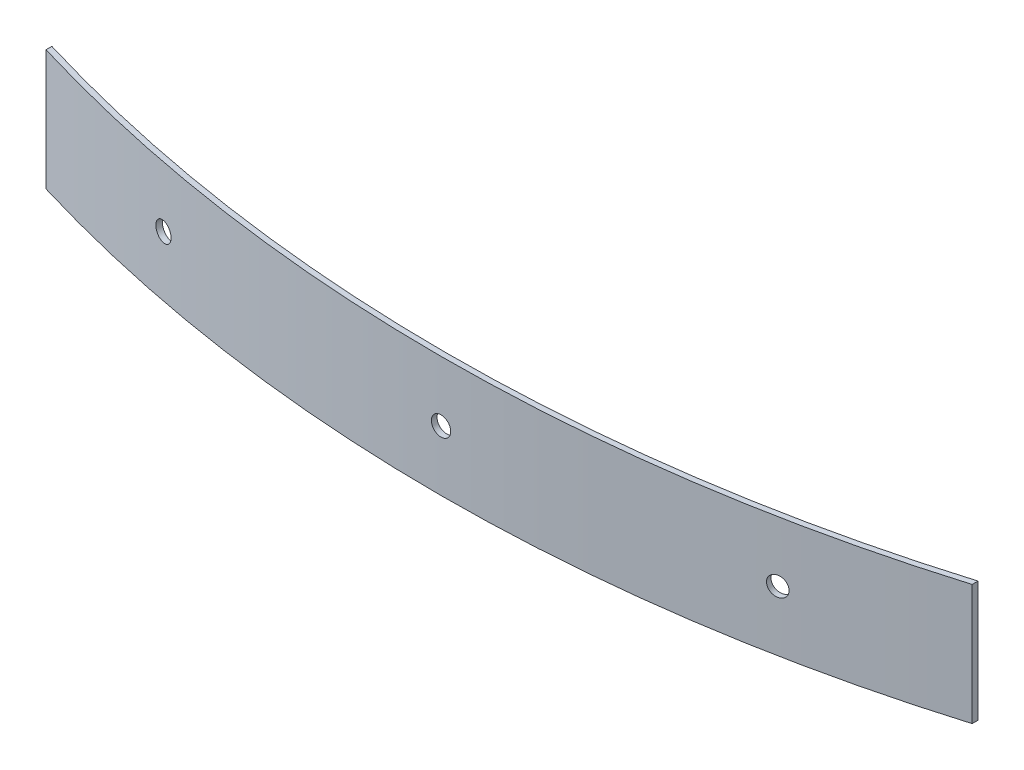
ISO-10303-21;
HEADER;
FILE_DESCRIPTION(('STEP AP214'),'2;1');
FILE_NAME('part.step','',(''),(''),'','','');
FILE_SCHEMA(('AUTOMOTIVE_DESIGN { 1 0 10303 214 1 1 1 1 }'));
ENDSEC;
DATA;
#1=APPLICATION_CONTEXT('core data for automotive mechanical design processes');
#2=APPLICATION_PROTOCOL_DEFINITION('international standard','automotive_design',2000,#1);
#3=PRODUCT_CONTEXT('',#1,'mechanical');
#4=PRODUCT('Part','Part','',(#3));
#5=PRODUCT_RELATED_PRODUCT_CATEGORY('part','',(#4));
#6=PRODUCT_DEFINITION_FORMATION('','',#4);
#7=PRODUCT_DEFINITION_CONTEXT('part definition',#1,'design');
#8=PRODUCT_DEFINITION('design','',#6,#7);
#9=PRODUCT_DEFINITION_SHAPE('','',#8);
#10=(LENGTH_UNIT() NAMED_UNIT(*) SI_UNIT(.MILLI.,.METRE.));
#11=(NAMED_UNIT(*) PLANE_ANGLE_UNIT() SI_UNIT($,.RADIAN.));
#12=(NAMED_UNIT(*) SI_UNIT($,.STERADIAN.) SOLID_ANGLE_UNIT());
#13=UNCERTAINTY_MEASURE_WITH_UNIT(LENGTH_MEASURE(1.E-05),#10,'distance_accuracy_value','');
#14=(GEOMETRIC_REPRESENTATION_CONTEXT(3) GLOBAL_UNCERTAINTY_ASSIGNED_CONTEXT((#13)) GLOBAL_UNIT_ASSIGNED_CONTEXT((#10,
#11,#12)) REPRESENTATION_CONTEXT('',''));
#15=CARTESIAN_POINT('',(0.,0.,0.));
#16=DIRECTION('',(0.,0.,1.));
#17=DIRECTION('',(1.,0.,0.));
#18=AXIS2_PLACEMENT_3D('',#15,#16,#17);
#19=CARTESIAN_POINT('',(40.4843717008192,387.477,-29.2982016179473));
#20=DIRECTION('',(0.190808995376545,0.,0.981627183447664));
#21=DIRECTION('',(0.981627183447664,0.,-0.190808995376545));
#22=AXIS2_PLACEMENT_3D('',#19,#20,#21);
#23=CYLINDRICAL_SURFACE('',#22,1.52400000000001);
#24=CARTESIAN_POINT('',(49.8636795486858,387.477,10.967109408025));
#25=CARTESIAN_POINT('',(49.863676090031,387.391468363897,10.9671101371769));
#26=CARTESIAN_POINT('',(49.8565909918501,387.305821015081,10.9685318877674));
#27=CARTESIAN_POINT('',(49.8284117889358,387.136831434247,10.9741828677333));
#28=CARTESIAN_POINT('',(49.8072877007544,387.05349453441,10.9784181059413));
#29=CARTESIAN_POINT('',(49.7516270676304,386.891678201409,10.9895654870844));
#30=CARTESIAN_POINT('',(49.7171017141455,386.813194778319,10.9964753963762));
#31=CARTESIAN_POINT('',(49.6356334347848,386.663294870702,11.0127562341792));
#32=CARTESIAN_POINT('',(49.5886963890027,386.591875061712,11.0221259973087));
#33=CARTESIAN_POINT('',(49.483714499149,386.458067156038,11.0430443220652));
#34=CARTESIAN_POINT('',(49.425667381307,386.395680912749,11.0545933296861));
#35=CARTESIAN_POINT('',(49.3001094634721,386.281724946985,11.0795205758699));
#36=CARTESIAN_POINT('',(49.2325978486417,386.230156156785,11.0928989719298));
#37=CARTESIAN_POINT('',(49.0900293943002,386.139306832435,11.1210832489984));
#38=CARTESIAN_POINT('',(49.0149727823577,386.100025927812,11.1358890869528));
#39=CARTESIAN_POINT('',(48.8594406720576,386.034865851215,11.1664905494899));
#40=CARTESIAN_POINT('',(48.7789652320242,386.008986535022,11.1822861634193));
#41=CARTESIAN_POINT('',(48.6148773814232,385.971363808313,11.2144063969075));
#42=CARTESIAN_POINT('',(48.5312649925577,385.959620300019,11.2307310128065));
#43=CARTESIAN_POINT('',(48.3632751458043,385.950602280154,11.2634400821675));
#44=CARTESIAN_POINT('',(48.2788976879837,385.953327767309,11.2798245356243));
#45=CARTESIAN_POINT('',(48.1117747959555,385.973170162921,11.3121892348023));
#46=CARTESIAN_POINT('',(48.0290293319527,385.990286808391,11.3281694879044));
#47=CARTESIAN_POINT('',(47.8675184506354,386.038425531047,11.3592810837368));
#48=CARTESIAN_POINT('',(47.7887530760175,386.069447757373,11.3744124173603));
#49=CARTESIAN_POINT('',(47.6374386382165,386.144518576551,11.4034116710556));
#50=CARTESIAN_POINT('',(47.5648898504967,386.188567746257,11.4172795351435));
#51=CARTESIAN_POINT('',(47.4280815732209,386.288437517213,11.4433753323079));
#52=CARTESIAN_POINT('',(47.3638213713957,386.344257105899,11.4556034063013));
#53=CARTESIAN_POINT('',(47.2454215969543,386.466073262848,11.478093308561));
#54=CARTESIAN_POINT('',(47.1912802279839,386.532068020951,11.4883554858328));
#55=CARTESIAN_POINT('',(47.0946210330584,386.672408184816,11.5066508012766));
#56=CARTESIAN_POINT('',(47.0521087197986,386.746757527548,11.5146828823098));
#57=CARTESIAN_POINT('',(46.9799236400397,386.901714043098,11.5283077204086));
#58=CARTESIAN_POINT('',(46.9502616084478,386.98232638188,11.5338984380318));
#59=CARTESIAN_POINT('',(46.9047202760055,387.147362145013,11.5424775595317));
#60=CARTESIAN_POINT('',(46.8888116411892,387.231777052148,11.5454715019914));
#61=CARTESIAN_POINT('',(46.8772100264779,387.343438639964,11.5476546828771));
#62=CARTESIAN_POINT('',(46.8751376769039,387.370104280899,11.548044629191));
#63=CARTESIAN_POINT('',(46.8723720662374,387.423509508253,11.5485649976085));
#64=CARTESIAN_POINT('',(46.8716788051456,387.450249094673,11.5486954197119));
#65=CARTESIAN_POINT('',(46.8716833734913,387.562531636103,11.5486946063558));
#66=CARTESIAN_POINT('',(46.878785159278,387.648178984919,11.5473587060549));
#67=CARTESIAN_POINT('',(46.9070293556091,387.817168565752,11.5420420882328));
#68=CARTESIAN_POINT('',(46.9282018172708,387.90050546559,11.5380557100068));
#69=CARTESIAN_POINT('',(46.9839853401138,388.062321798591,11.5275405416615));
#70=CARTESIAN_POINT('',(47.0185851880189,388.14080522168,11.5210138729379));
#71=CARTESIAN_POINT('',(47.1002201704887,388.290705129298,11.5055906482849));
#72=CARTESIAN_POINT('',(47.147249416566,388.362124938288,11.4966952145543));
#73=CARTESIAN_POINT('',(47.2524230722372,388.495932843962,11.4767634394047));
#74=CARTESIAN_POINT('',(47.3105697571067,388.558319087251,11.4657266597346));
#75=CARTESIAN_POINT('',(47.4363229421123,388.672275053015,11.4418039760585));
#76=CARTESIAN_POINT('',(47.5039302567522,388.723843843215,11.4289179128376));
#77=CARTESIAN_POINT('',(47.6466754418087,388.814693167564,11.4016428364789));
#78=CARTESIAN_POINT('',(47.721813085099,388.853974072188,11.3872538686703));
#79=CARTESIAN_POINT('',(47.8774834562706,388.919134148785,11.3573636966545));
#80=CARTESIAN_POINT('',(47.9580161260837,388.945013464978,11.3418625044183));
#81=CARTESIAN_POINT('',(48.1221881831383,388.982636191687,11.310175475579));
#82=CARTESIAN_POINT('',(48.2058275488868,388.994379699981,11.2939896437123));
#83=CARTESIAN_POINT('',(48.3738380555749,389.003397719846,11.2613868605009));
#84=CARTESIAN_POINT('',(48.4582091964499,389.000672232691,11.2449699091766));
#85=CARTESIAN_POINT('',(48.6252868733729,388.980829837078,11.2123725984479));
#86=CARTESIAN_POINT('',(48.7079934398115,388.963713191609,11.1961922347254));
#87=CARTESIAN_POINT('',(48.8693983302363,388.915574468953,11.1645353630211));
#88=CARTESIAN_POINT('',(48.9480966112234,388.884552242628,11.1490588625902));
#89=CARTESIAN_POINT('',(49.0992562265538,388.809481423449,11.1192631163317));
#90=CARTESIAN_POINT('',(49.1717172845199,388.765432253743,11.1049439217871));
#91=CARTESIAN_POINT('',(49.3083393680594,388.665562482787,11.0778902408885));
#92=CARTESIAN_POINT('',(49.3725011068256,388.609742894101,11.0651556183697));
#93=CARTESIAN_POINT('',(49.4907043317438,388.487926737152,11.041654556471));
#94=CARTESIAN_POINT('',(49.5447476141861,388.421931979049,11.0308877677573));
#95=CARTESIAN_POINT('',(49.6412220049104,388.281591815184,11.0116417171176));
#96=CARTESIAN_POINT('',(49.6836476058991,388.207242472452,11.0031635401216));
#97=CARTESIAN_POINT('',(49.7556804005782,388.052285956902,10.988755263204));
#98=CARTESIAN_POINT('',(49.7852768770475,387.97167361812,10.9828272937113));
#99=CARTESIAN_POINT('',(49.8307158606831,387.806637854987,10.9737216332465));
#100=CARTESIAN_POINT('',(49.8465876406186,387.722222947852,10.9705380888621));
#101=CARTESIAN_POINT('',(49.8581623044203,387.610561360036,10.9682162575659));
#102=CARTESIAN_POINT('',(49.8602298299466,387.583895719101,10.967801493678));
#103=CARTESIAN_POINT('',(49.8629889929448,387.530490491747,10.9672479548826));
#104=CARTESIAN_POINT('',(49.8636806304159,387.503750905327,10.9671091799752));
#105=CARTESIAN_POINT('',(49.8636795486858,387.477,10.967109408025));
#106=B_SPLINE_CURVE_WITH_KNOTS('',3,(#24,#25,#26,#27,#28,#29,#30,#31,#32,#33,#34,#35,#36,#37,
#38,#39,#40,#41,#42,#43,#44,#45,#46,#47,#48,#49,#50,#51,#52,#53,#54,#55,#56,#57,#58,#59,#60,#61,
#62,#63,#64,#65,#66,#67,#68,#69,#70,#71,#72,#73,#74,#75,#76,#77,#78,#79,#80,#81,#82,#83,#84,#85,
#86,#87,#88,#89,#90,#91,#92,#93,#94,#95,#96,#97,#98,#99,#100,#101,#102,#103,#104,#105),
.UNSPECIFIED.,.T.,.F.,(4,2,2,2,2,2,2,2,2,2,2,2,2,2,2,2,2,2,2,2,2,2,2,2,2,2,2,2,2,2,2,2,2,2,2,2,
2,2,2,2,4),(0.,0.256493168327267,0.513535903988114,0.77036444232639,1.0270715243331,
1.28383119990633,1.54061299457057,1.79738704663225,2.05415833541299,2.31092784811537,
2.56769733822554,2.82446213615993,3.08122968797572,3.33800861154674,3.59476545442572,
3.85147667295178,4.10830937407786,4.36535621708922,4.62185345491072,4.70207435061589,
4.78229524636296,5.03878841469023,5.29583115035106,5.55265968868932,5.80936677069605,
6.06612644626929,6.32290824093351,6.5796822929952,6.83645358177596,7.09322309447831,
7.34999258458847,7.60675738252288,7.86352493433864,8.12030385790964,8.37706070078866,
8.63377191931469,8.8906046204408,9.14765146345223,9.40414870127374,9.48436959697925,
9.56459049272649),.UNSPECIFIED.);
#107=CARTESIAN_POINT('',(49.8636795486858,387.477,10.967109408025));
#108=VERTEX_POINT('',#107);
#109=EDGE_CURVE('E94',#108,#108,#106,.T.);
#110=ORIENTED_EDGE('',*,*,#109,.T.);
#111=EDGE_LOOP('',(#110));
#112=FACE_BOUND('',#111,.T.);
#113=CARTESIAN_POINT('',(50.0333118005202,387.477,11.8397916904378));
#114=CARTESIAN_POINT('',(50.0333083418317,387.391468357998,11.8397924193975));
#115=CARTESIAN_POINT('',(50.0262232135201,387.305821003216,11.8412140201642));
#116=CARTESIAN_POINT('',(49.998043892993,387.136831410311,11.8468644166623));
#117=CARTESIAN_POINT('',(49.9769197171932,387.05349450437,11.8510992206214));
#118=CARTESIAN_POINT('',(49.921258860632,386.891678159086,11.8622454987522));
#119=CARTESIAN_POINT('',(49.8867333713161,386.813194729835,11.8691547394868));
#120=CARTESIAN_POINT('',(49.8052647868026,386.66329481109,11.8854340814312));
#121=CARTESIAN_POINT('',(49.7583275717262,386.591874997129,11.8948030173324));
#122=CARTESIAN_POINT('',(49.653345332499,386.458067089033,11.9157196209964));
#123=CARTESIAN_POINT('',(49.5952980354506,386.395680847581,11.927267734568));
#124=CARTESIAN_POINT('',(49.4697397662749,386.281724886822,11.9521932273473));
#125=CARTESIAN_POINT('',(49.4022279793126,386.230156099788,11.9655707640547));
#126=CARTESIAN_POINT('',(49.259659211236,386.139306785595,11.9937534533115));
#127=CARTESIAN_POINT('',(49.1846024580877,386.100025887312,12.0085585627273));
#128=CARTESIAN_POINT('',(49.0290701090603,386.034865822913,12.0391587817464));
#129=CARTESIAN_POINT('',(48.9485945715018,386.008986512585,12.0549538806948));
#130=CARTESIAN_POINT('',(48.784506573435,385.971363794815,12.0870733572215));
#131=CARTESIAN_POINT('',(48.7008941343601,385.959620290805,12.1033977311835));
#132=CARTESIAN_POINT('',(48.5329042462869,385.950602280327,12.1361066157797));
#133=CARTESIAN_POINT('',(48.4485267973555,385.953327772595,12.1524911264088));
#134=CARTESIAN_POINT('',(48.2814039729984,385.973170180107,12.1848562341798));
#135=CARTESIAN_POINT('',(48.1986585679236,385.990286833662,12.2008368386611));
#136=CARTESIAN_POINT('',(48.0371478550634,386.038425575947,12.2319493904473));
#137=CARTESIAN_POINT('',(47.9583825899741,386.069447813812,12.2470813286487));
#138=CARTESIAN_POINT('',(47.8070684129948,386.144518657696,12.2760819759015));
#139=CARTESIAN_POINT('',(47.7345197762846,386.188567839972,12.2899506290352));
#140=CARTESIAN_POINT('',(47.5977118224509,386.288437637766,12.3160481002875));
#141=CARTESIAN_POINT('',(47.5334517930494,386.34425724071,12.3282770593161));
#142=CARTESIAN_POINT('',(47.4150523728785,386.466073420107,12.3507687263608));
#143=CARTESIAN_POINT('',(47.3609111846376,386.532068185275,12.3610317836));
#144=CARTESIAN_POINT('',(47.2642523325177,386.672408361002,12.3793287565694));
#145=CARTESIAN_POINT('',(47.2217401813286,386.746757708532,12.3873616151113));
#146=CARTESIAN_POINT('',(47.1495553895778,386.901714230636,12.400987818055));
#147=CARTESIAN_POINT('',(47.1198934838635,386.982326571158,12.4065791228607));
#148=CARTESIAN_POINT('',(47.0743523527109,387.147362334862,12.4151591602165));
#149=CARTESIAN_POINT('',(47.0584437934114,387.231777240835,12.4181534318999));
#150=CARTESIAN_POINT('',(47.0468422428775,387.343438795619,12.4203368518533));
#151=CARTESIAN_POINT('',(47.0447699065702,387.370104405594,12.4207268406241));
#152=CARTESIAN_POINT('',(47.0420043136281,387.423509570751,12.4212472657896));
#153=CARTESIAN_POINT('',(47.0413110569942,387.450249125933,12.4213777021841));
#154=CARTESIAN_POINT('',(47.0413156252849,387.562531642002,12.4213768885776));
#155=CARTESIAN_POINT('',(47.0484173828835,387.648178996785,12.4200408380755));
#156=CARTESIAN_POINT('',(47.0766614696924,387.81716858969,12.4147236352129));
#157=CARTESIAN_POINT('',(47.0978338499199,387.90050549563,12.410736821536));
#158=CARTESIAN_POINT('',(47.1536171667348,388.062321840914,12.4002205467944));
#159=CARTESIAN_POINT('',(47.1882168901342,388.140805270166,12.3936932073122));
#160=CARTESIAN_POINT('',(47.2698515951784,388.29070518891,12.378268481411));
#161=CARTESIAN_POINT('',(47.3168806883374,388.362125002871,12.3693722172688));
#162=CARTESIAN_POINT('',(47.4220540232096,388.495932910967,12.3494387154724));
#163=CARTESIAN_POINT('',(47.4802005393196,388.558319152419,12.3384010397224));
#164=CARTESIAN_POINT('',(47.6059533932459,388.672275113178,12.3144765987033));
#165=CARTESIAN_POINT('',(47.6735605455646,388.723843900212,12.3015896742229));
#166=CARTESIAN_POINT('',(47.8163054267065,388.814693214406,12.2743130081434));
#167=CARTESIAN_POINT('',(47.8914429280052,388.853974112688,12.2599233119491));
#168=CARTESIAN_POINT('',(48.0471130546909,388.919134177087,12.2300318975348));
#169=CARTESIAN_POINT('',(48.1276456220123,388.945013487415,12.2145301912828));
#170=CARTESIAN_POINT('',(48.2918175322321,388.982636205185,12.1828424053593));
#171=CARTESIAN_POINT('',(48.3754568539029,388.994379709195,12.1666563303637));
#172=CARTESIAN_POINT('',(48.5434673296878,389.003397719673,12.1340533603628));
#173=CARTESIAN_POINT('',(48.6278384837381,389.000672227405,12.1176364653777));
#174=CARTESIAN_POINT('',(48.7949162509792,388.980829819893,12.0850395588399));
#175=CARTESIAN_POINT('',(48.8776228944096,388.963713166338,12.0688595429852));
#176=CARTESIAN_POINT('',(49.0390279867503,388.915574424053,12.0372036207311));
#177=CARTESIAN_POINT('',(49.1177263926632,388.884552186188,12.021727721885));
#178=CARTESIAN_POINT('',(49.2688862881996,388.809481342303,11.9919333654161));
#179=CARTESIAN_POINT('',(49.3413475017338,388.765432160027,11.9776149590313));
#180=CARTESIAN_POINT('',(49.4779699125073,388.665562362234,11.9505629514836));
#181=CARTESIAN_POINT('',(49.5421318229451,388.60974275929,11.9378292141462));
#182=CARTESIAN_POINT('',(49.6603353804895,388.487926579893,11.9143299212397));
#183=CARTESIAN_POINT('',(49.7143788250039,388.421931814724,11.90356401612));
#184=CARTESIAN_POINT('',(49.8108535188043,388.281591638997,11.8843196307285));
#185=CARTESIAN_POINT('',(49.8532792607835,388.207242291467,11.8758422353388));
#186=CARTESIAN_POINT('',(49.925312299706,388.052285769364,11.8614353317731));
#187=CARTESIAN_POINT('',(49.9549088794259,387.971673428842,11.8555079538611));
#188=CARTESIAN_POINT('',(50.0003480195146,387.806637665138,11.8464032179675));
#189=CARTESIAN_POINT('',(50.0162198527615,387.722222759165,11.8432200071233));
#190=CARTESIAN_POINT('',(50.0277945466152,387.610561204381,11.8408984215279));
#191=CARTESIAN_POINT('',(50.0298620757455,387.583895594406,11.8404837019752));
#192=CARTESIAN_POINT('',(50.032621243568,387.53049042925,11.8399302224354));
#193=CARTESIAN_POINT('',(50.0333128822595,387.503750874068,11.8397914624484));
#194=CARTESIAN_POINT('',(50.0333118005202,387.477,11.8397916904378));
#195=B_SPLINE_CURVE_WITH_KNOTS('',3,(#113,#114,#115,#116,#117,#118,#119,#120,#121,#122,#123,
#124,#125,#126,#127,#128,#129,#130,#131,#132,#133,#134,#135,#136,#137,#138,#139,#140,#141,#142,
#143,#144,#145,#146,#147,#148,#149,#150,#151,#152,#153,#154,#155,#156,#157,#158,#159,#160,#161,
#162,#163,#164,#165,#166,#167,#168,#169,#170,#171,#172,#173,#174,#175,#176,#177,#178,#179,#180,
#181,#182,#183,#184,#185,#186,#187,#188,#189,#190,#191,#192,#193,#194),.UNSPECIFIED.,.T.,.F.,(4,
2,2,2,2,2,2,2,2,2,2,2,2,2,2,2,2,2,2,2,2,2,2,2,2,2,2,2,2,2,2,2,2,2,2,2,2,2,2,2,4),(0.,
0.256493186147648,0.513535939917273,0.770364497343413,1.0270715981845,1.2838312723373,
1.54061306552852,1.79738710256763,2.05415837647021,2.3109278962541,2.56769739360345,
2.82446222194763,3.08122980409442,3.33800874622548,3.59476560744922,3.85147681594877,
4.10830950711869,4.36535633957911,4.6218535668253,4.70207436883022,4.78229517087661,
5.03878835702421,5.2958311107939,5.55265966822007,5.80936676906112,6.06612644321396,
6.32290823640518,6.57968227344427,6.83645354734683,7.09322306713074,7.34999256448009,
7.60675739282429,7.86352497497107,8.12030391710208,8.37706077832584,8.63377198682536,
8.89060467799531,9.14765151045561,9.4041487377019,9.48436953970654,9.56459034175266),.UNSPECIFIED.);
#196=CARTESIAN_POINT('',(50.0333118005202,387.477,11.8397916904378));
#197=VERTEX_POINT('',#196);
#198=EDGE_CURVE('E22',#197,#197,#195,.T.);
#199=ORIENTED_EDGE('',*,*,#198,.F.);
#200=EDGE_LOOP('',(#199));
#201=FACE_BOUND('',#200,.T.);
#202=ADVANCED_FACE('F18',(#112,#201),#23,.F.);
#203=CARTESIAN_POINT('',(73.1710645902476,508.,-1.57694107850936));
#204=DIRECTION('',(1.,0.,0.));
#205=DIRECTION('',(0.,0.,-1.));
#206=AXIS2_PLACEMENT_3D('',#203,#204,#205);
#207=PLANE('',#206);
#208=DIRECTION('',(0.,0.,1.));
#209=VECTOR('',#208,1.);
#210=CARTESIAN_POINT('',(73.1710645902476,397.002,-237.572238635431));
#211=LINE('',#210,#209);
#212=CARTESIAN_POINT('',(73.1710645902476,397.002,6.05799033406691));
#213=VERTEX_POINT('',#212);
#214=CARTESIAN_POINT('',(73.1710645902476,397.002,5.12961420201645));
#215=VERTEX_POINT('',#214);
#216=EDGE_CURVE('E71',#213,#215,#211,.F.);
#217=ORIENTED_EDGE('',*,*,#216,.F.);
#218=DIRECTION('',(0.,1.,0.));
#219=VECTOR('',#218,1.);
#220=CARTESIAN_POINT('',(73.1710645902476,508.,6.0579903340669));
#221=LINE('',#220,#219);
#222=CARTESIAN_POINT('',(73.1710645902476,377.952,6.05799033406691));
#223=VERTEX_POINT('',#222);
#224=EDGE_CURVE('E69',#213,#223,#221,.F.);
#225=ORIENTED_EDGE('',*,*,#224,.T.);
#226=DIRECTION('',(0.,0.,1.));
#227=VECTOR('',#226,1.);
#228=CARTESIAN_POINT('',(73.1710645902476,377.952,-237.572238635431));
#229=LINE('',#228,#227);
#230=CARTESIAN_POINT('',(73.1710645902476,377.952,5.12961420201645));
#231=VERTEX_POINT('',#230);
#232=EDGE_CURVE('E121',#223,#231,#229,.F.);
#233=ORIENTED_EDGE('',*,*,#232,.T.);
#234=DIRECTION('',(0.,1.,0.));
#235=VECTOR('',#234,1.);
#236=CARTESIAN_POINT('',(73.1710645902476,379.222,5.12961420201644));
#237=LINE('',#236,#235);
#238=EDGE_CURVE('E90',#231,#215,#237,.T.);
#239=ORIENTED_EDGE('',*,*,#238,.T.);
#240=EDGE_LOOP('',(#217,#225,#233,#239));
#241=FACE_BOUND('',#240,.T.);
#242=ADVANCED_FACE('F132',(#241),#207,.T.);
#243=CARTESIAN_POINT('',(0.,379.222,-237.572238635431));
#244=DIRECTION('',(0.,1.,0.));
#245=DIRECTION('',(0.,0.,1.));
#246=AXIS2_PLACEMENT_3D('',#243,#244,#245);
#247=CYLINDRICAL_SURFACE('',#246,254.381);
#248=CARTESIAN_POINT('',(-1.52400000000004,387.477,16.8041961713337));
#249=CARTESIAN_POINT('',(-1.52399635354439,387.562610232708,16.8041962308288));
#250=CARTESIAN_POINT('',(-1.51676266137329,387.648277180474,16.8042398498584));
#251=CARTESIAN_POINT('',(-1.48800823542495,387.817245920656,16.8044096469713));
#252=CARTESIAN_POINT('',(-1.46647171451255,387.900544993401,16.8045359162799));
#253=CARTESIAN_POINT('',(-1.40972442342295,388.062315641181,16.8048567143857));
#254=CARTESIAN_POINT('',(-1.37451942945186,388.140789239226,16.8050512143457));
#255=CARTESIAN_POINT('',(-1.29144398495152,388.290689380939,16.8054865103019));
#256=CARTESIAN_POINT('',(-1.24357684679906,388.362117760915,16.8057272941857));
#257=CARTESIAN_POINT('',(-1.13653171561487,388.495927204711,16.8062280500414));
#258=CARTESIAN_POINT('',(-1.07735359541627,388.558308166798,16.8064880222288));
#259=CARTESIAN_POINT('',(-0.949346645211421,388.672266043418,16.8069979174442));
#260=CARTESIAN_POINT('',(-0.880515295172995,388.723840127957,16.8072478378259));
#261=CARTESIAN_POINT('',(-0.735146804189286,388.814717858364,16.8077094770297));
#262=CARTESIAN_POINT('',(-0.658606368355173,388.854016227869,16.8079211794083));
#263=CARTESIAN_POINT('',(-0.500069174402144,388.919163619508,16.8082821403632));
#264=CARTESIAN_POINT('',(-0.418078536162053,388.945027448499,16.8084314676504));
#265=CARTESIAN_POINT('',(-0.279694921879424,388.976171848308,16.808613549031));
#266=CARTESIAN_POINT('',(-0.224172949217212,388.985470074983,16.808668721772));
#267=CARTESIAN_POINT('',(-0.112442141035052,388.997885348373,16.8087426490781));
#268=CARTESIAN_POINT('',(-0.0562333055256263,389.001002395184,16.8087614036438));
#269=CARTESIAN_POINT('',(0.0856102327227683,389.000996353544,16.808761305082));
#270=CARTESIAN_POINT('',(0.171277180504207,388.993762661371,16.808717686882));
#271=CARTESIAN_POINT('',(0.340245920718327,388.965008235411,16.808547892642));
#272=CARTESIAN_POINT('',(0.423544993480046,388.943471714491,16.808421625378));
#273=CARTESIAN_POINT('',(0.585315641296282,388.886724423377,16.8081008317467));
#274=CARTESIAN_POINT('',(0.663789239358908,388.851519429389,16.8079063342164));
#275=CARTESIAN_POINT('',(0.813689381102889,388.76844398485,16.8074710424001));
#276=CARTESIAN_POINT('',(0.885117761091838,388.720576846675,16.8072302602264));
#277=CARTESIAN_POINT('',(1.01892720487308,388.613531715468,16.8067295063414));
#278=CARTESIAN_POINT('',(1.08130816693737,388.554353595274,16.8064695344143));
#279=CARTESIAN_POINT('',(1.19526604351424,388.426346645089,16.8059596381373));
#280=CARTESIAN_POINT('',(1.24684012803135,388.357515295065,16.8057097164331));
#281=CARTESIAN_POINT('',(1.33771785841703,388.212146804093,16.8052480736206));
#282=CARTESIAN_POINT('',(1.37701622791746,388.135606368254,16.8050363689552));
#283=CARTESIAN_POINT('',(1.44216361954611,387.977069174292,16.8046754033987));
#284=CARTESIAN_POINT('',(1.46802744853206,387.895078536046,16.8045260737967));
#285=CARTESIAN_POINT('',(1.49917184832616,387.756694921778,16.8043439894566));
#286=CARTESIAN_POINT('',(1.50847007499384,387.701172949136,16.8042888157703));
#287=CARTESIAN_POINT('',(1.52088534837535,387.589442140994,16.8042148871694));
#288=CARTESIAN_POINT('',(1.5240023951839,387.533233305505,16.8041961322541));
#289=CARTESIAN_POINT('',(1.52399635354437,387.391389767293,16.8041962308287));
#290=CARTESIAN_POINT('',(1.5167626613733,387.305722819527,16.8042398498584));
#291=CARTESIAN_POINT('',(1.488008235425,387.136754079345,16.8044096469713));
#292=CARTESIAN_POINT('',(1.46647171451263,387.0534550066,16.8045359162799));
#293=CARTESIAN_POINT('',(1.40972442342307,386.891684358819,16.8048567143857));
#294=CARTESIAN_POINT('',(1.37451942945201,386.813210760775,16.8050512143458));
#295=CARTESIAN_POINT('',(1.2914439849517,386.663310619062,16.8054865103019));
#296=CARTESIAN_POINT('',(1.24357684679925,386.591882239085,16.8057272941858));
#297=CARTESIAN_POINT('',(1.1365317156151,386.45807279529,16.8062280500414));
#298=CARTESIAN_POINT('',(1.07735359541652,386.395691833203,16.8064880222288));
#299=CARTESIAN_POINT('',(0.949346645211702,386.281733956582,16.8069979174441));
#300=CARTESIAN_POINT('',(0.880515295173293,386.230159872044,16.807247837826));
#301=CARTESIAN_POINT('',(0.735146804189617,386.139282141636,16.8077094770297));
#302=CARTESIAN_POINT('',(0.65860636835552,386.099983772131,16.8079211794083));
#303=CARTESIAN_POINT('',(0.500069174402521,386.034836380492,16.8082821403632));
#304=CARTESIAN_POINT('',(0.418078536162445,386.008972551501,16.8084314676504));
#305=CARTESIAN_POINT('',(0.279694921879753,385.977828151692,16.808613549031));
#306=CARTESIAN_POINT('',(0.224172949217464,385.968529925017,16.808668721772));
#307=CARTESIAN_POINT('',(0.11244214103515,385.956114651627,16.8087426490781));
#308=CARTESIAN_POINT('',(0.0562333055256482,385.952997604816,16.8087614036438));
#309=CARTESIAN_POINT('',(-0.0856102327228215,385.953003646455,16.8087613050819));
#310=CARTESIAN_POINT('',(-0.17127718050426,385.960237338629,16.808717686882));
#311=CARTESIAN_POINT('',(-0.340245920718379,385.988991764588,16.808547892642));
#312=CARTESIAN_POINT('',(-0.423544993480096,386.010528285509,16.808421625378));
#313=CARTESIAN_POINT('',(-0.585315641296333,386.067275576623,16.8081008317467));
#314=CARTESIAN_POINT('',(-0.66378923935896,386.102480570611,16.8079063342164));
#315=CARTESIAN_POINT('',(-0.813689381102941,386.18555601515,16.8074710424));
#316=CARTESIAN_POINT('',(-0.885117761091888,386.233423153325,16.8072302602264));
#317=CARTESIAN_POINT('',(-1.01892720487312,386.340468284532,16.8067295063414));
#318=CARTESIAN_POINT('',(-1.08130816693741,386.399646404726,16.8064695344143));
#319=CARTESIAN_POINT('',(-1.19526604351428,386.527653354911,16.8059596381373));
#320=CARTESIAN_POINT('',(-1.2468401280314,386.596484704935,16.8057097164331));
#321=CARTESIAN_POINT('',(-1.33771785841709,386.741853195907,16.8052480736206));
#322=CARTESIAN_POINT('',(-1.37701622791753,386.818393631745,16.8050363689552));
#323=CARTESIAN_POINT('',(-1.44216361954617,386.976930825708,16.8046754033987));
#324=CARTESIAN_POINT('',(-1.46802744853212,387.058921463954,16.8045260737967));
#325=CARTESIAN_POINT('',(-1.49917184832624,387.197305078222,16.8043439894566));
#326=CARTESIAN_POINT('',(-1.50847007499392,387.252827050864,16.8042888157703));
#327=CARTESIAN_POINT('',(-1.52088534837544,387.364557859006,16.8042148871694));
#328=CARTESIAN_POINT('',(-1.52400239518397,387.420766694495,16.8041961322542));
#329=CARTESIAN_POINT('',(-1.52400000000004,387.477,16.8041961713337));
#330=B_SPLINE_CURVE_WITH_KNOTS('',3,(#248,#249,#250,#251,#252,#253,#254,#255,#256,#257,#258,
#259,#260,#261,#262,#263,#264,#265,#266,#267,#268,#269,#270,#271,#272,#273,#274,#275,#276,#277,
#278,#279,#280,#281,#282,#283,#284,#285,#286,#287,#288,#289,#290,#291,#292,#293,#294,#295,#296,
#297,#298,#299,#300,#301,#302,#303,#304,#305,#306,#307,#308,#309,#310,#311,#312,#313,#314,#315,
#316,#317,#318,#319,#320,#321,#322,#323,#324,#325,#326,#327,#328,#329),.UNSPECIFIED.,.T.,.F.,(4,
2,2,2,2,2,2,2,2,2,2,2,2,2,2,2,2,2,2,2,2,2,2,2,2,2,2,2,2,2,2,2,2,2,2,2,2,2,2,2,4),(0.,
0.256626105801758,0.513535941455357,0.770337326679153,1.02707159979487,1.28380875948736,
1.54061306711075,1.79752760330301,2.05415837749811,2.22272390965653,2.3912894392323,
2.64791554508076,2.90482538078008,3.16162676605713,3.41836103922532,3.67509819885677,
3.93190250642069,4.18881704263599,4.44544781685262,4.61401334895021,4.78257887846503,
5.03920498426683,5.29611481992047,5.55291620514429,5.80965047826003,6.06638763795252,
6.3231919455759,6.58010648176815,6.83673725596322,7.00530278812188,7.17386831769787,
7.43049442354634,7.68740425924565,7.94420564452271,8.20093991769089,8.45767707732229,
8.71448138488627,8.97139592110163,9.2280266953182,9.39659222741607,9.56515775693116),.UNSPECIFIED.);
#331=CARTESIAN_POINT('',(-1.52400000000004,387.477,16.8041961713337));
#332=VERTEX_POINT('',#331);
#333=EDGE_CURVE('E72',#332,#332,#330,.T.);
#334=ORIENTED_EDGE('',*,*,#333,.T.);
#335=EDGE_LOOP('',(#334));
#336=FACE_BOUND('',#335,.T.);
#337=CARTESIAN_POINT('',(0.,397.002,-237.572238635431));
#338=DIRECTION('',(0.,1.,0.));
#339=DIRECTION('',(0.,0.,1.));
#340=AXIS2_PLACEMENT_3D('',#337,#338,#339);
#341=CIRCLE('',#340,254.381);
#342=CARTESIAN_POINT('',(-73.1710645902477,397.002,6.05799033406691));
#343=VERTEX_POINT('',#342);
#344=EDGE_CURVE('E60',#343,#213,#341,.T.);
#345=ORIENTED_EDGE('',*,*,#344,.F.);
#346=DIRECTION('',(0.,1.,0.));
#347=VECTOR('',#346,1.);
#348=CARTESIAN_POINT('',(-73.1710645902477,508.,6.0579903340669));
#349=LINE('',#348,#347);
#350=CARTESIAN_POINT('',(-73.1710645902477,377.952,6.05799033406691));
#351=VERTEX_POINT('',#350);
#352=EDGE_CURVE('E68',#351,#343,#349,.T.);
#353=ORIENTED_EDGE('',*,*,#352,.F.);
#354=CARTESIAN_POINT('',(0.,377.952,-237.572238635431));
#355=DIRECTION('',(0.,1.,0.));
#356=DIRECTION('',(0.,0.,1.));
#357=AXIS2_PLACEMENT_3D('',#354,#355,#356);
#358=CIRCLE('',#357,254.381);
#359=EDGE_CURVE('E84',#351,#223,#358,.T.);
#360=ORIENTED_EDGE('',*,*,#359,.T.);
#361=ORIENTED_EDGE('',*,*,#224,.F.);
#362=EDGE_LOOP('',(#345,#353,#360,#361));
#363=FACE_BOUND('',#362,.T.);
#364=CARTESIAN_POINT('',(-47.0413121453717,387.477,12.4213775083455));
#365=CARTESIAN_POINT('',(-47.0413156252849,387.391468357997,12.4213768885777));
#366=CARTESIAN_POINT('',(-47.0484173828835,387.305821003215,12.4200408380755));
#367=CARTESIAN_POINT('',(-47.0766614696924,387.13683141031,12.4147236352129));
#368=CARTESIAN_POINT('',(-47.0978338499199,387.05349450437,12.410736821536));
#369=CARTESIAN_POINT('',(-47.1536171667348,386.891678159085,12.4002205467944));
#370=CARTESIAN_POINT('',(-47.1882168901342,386.813194729834,12.3936932073122));
#371=CARTESIAN_POINT('',(-47.2698515951784,386.66329481109,12.378268481411));
#372=CARTESIAN_POINT('',(-47.3168806883374,386.591874997129,12.3693722172688));
#373=CARTESIAN_POINT('',(-47.4220540232096,386.458067089033,12.3494387154724));
#374=CARTESIAN_POINT('',(-47.4802005393196,386.395680847581,12.3384010397224));
#375=CARTESIAN_POINT('',(-47.6059533932459,386.281724886822,12.3144765987033));
#376=CARTESIAN_POINT('',(-47.6735605455646,386.230156099788,12.3015896742229));
#377=CARTESIAN_POINT('',(-47.8163054267065,386.139306785594,12.2743130081434));
#378=CARTESIAN_POINT('',(-47.8914429280052,386.100025887312,12.2599233119491));
#379=CARTESIAN_POINT('',(-48.0471130546909,386.034865822913,12.2300318975348));
#380=CARTESIAN_POINT('',(-48.1276456220123,386.008986512585,12.2145301912828));
#381=CARTESIAN_POINT('',(-48.2918175322321,385.971363794815,12.1828424053593));
#382=CARTESIAN_POINT('',(-48.3754568539029,385.959620290805,12.1666563303637));
#383=CARTESIAN_POINT('',(-48.5434673296878,385.950602280327,12.1340533603628));
#384=CARTESIAN_POINT('',(-48.6278384837381,385.953327772595,12.1176364653777));
#385=CARTESIAN_POINT('',(-48.7949162509792,385.973170180107,12.0850395588399));
#386=CARTESIAN_POINT('',(-48.8776228944096,385.990286833662,12.0688595429852));
#387=CARTESIAN_POINT('',(-49.0390279867503,386.038425575947,12.0372036207311));
#388=CARTESIAN_POINT('',(-49.1177263926631,386.069447813812,12.021727721885));
#389=CARTESIAN_POINT('',(-49.2688862881997,386.144518657696,11.9919333654161));
#390=CARTESIAN_POINT('',(-49.3413475017338,386.188567839972,11.9776149590313));
#391=CARTESIAN_POINT('',(-49.4779699125074,386.288437637766,11.9505629514836));
#392=CARTESIAN_POINT('',(-49.5421318229451,386.34425724071,11.9378292141462));
#393=CARTESIAN_POINT('',(-49.6603353804895,386.466073420107,11.9143299212397));
#394=CARTESIAN_POINT('',(-49.7143788250039,386.532068185276,11.90356401612));
#395=CARTESIAN_POINT('',(-49.8108535188043,386.672408361003,11.8843196307285));
#396=CARTESIAN_POINT('',(-49.8532792607835,386.746757708533,11.8758422353388));
#397=CARTESIAN_POINT('',(-49.925312299706,386.901714230636,11.8614353317731));
#398=CARTESIAN_POINT('',(-49.9549088794259,386.982326571158,11.8555079538611));
#399=CARTESIAN_POINT('',(-50.0003480195146,387.147362334862,11.8464032179675));
#400=CARTESIAN_POINT('',(-50.0162198527615,387.231777240835,11.8432200071233));
#401=CARTESIAN_POINT('',(-50.0277945466152,387.343438795619,11.8408984215279));
#402=CARTESIAN_POINT('',(-50.0298620757456,387.370104405594,11.8404837019752));
#403=CARTESIAN_POINT('',(-50.0326212435681,387.423509570751,11.8399302224354));
#404=CARTESIAN_POINT('',(-50.0333128822595,387.450249125933,11.8397914624484));
#405=CARTESIAN_POINT('',(-50.0333083418317,387.562531642003,11.8397924193975));
#406=CARTESIAN_POINT('',(-50.02622321352,387.648178996785,11.8412140201643));
#407=CARTESIAN_POINT('',(-49.9980438929928,387.81716858969,11.8468644166623));
#408=CARTESIAN_POINT('',(-49.9769197171929,387.900505495631,11.8510992206214));
#409=CARTESIAN_POINT('',(-49.9212588606315,388.062321840915,11.8622454987523));
#410=CARTESIAN_POINT('',(-49.8867333713157,388.140805270166,11.8691547394869));
#411=CARTESIAN_POINT('',(-49.805264786802,388.290705188911,11.8854340814314));
#412=CARTESIAN_POINT('',(-49.7583275717256,388.362125002872,11.8948030173325));
#413=CARTESIAN_POINT('',(-49.6533453324983,388.495932910967,11.9157196209966));
#414=CARTESIAN_POINT('',(-49.5952980354499,388.55831915242,11.9272677345682));
#415=CARTESIAN_POINT('',(-49.4697397662741,388.672275113179,11.9521932273474));
#416=CARTESIAN_POINT('',(-49.4022279793116,388.723843900213,11.9655707640549));
#417=CARTESIAN_POINT('',(-49.259659211235,388.814693214406,11.9937534533117));
#418=CARTESIAN_POINT('',(-49.1846024580867,388.853974112688,12.0085585627275));
#419=CARTESIAN_POINT('',(-49.0290701090592,388.919134177087,12.0391587817466));
#420=CARTESIAN_POINT('',(-48.9485945715008,388.945013487415,12.054953880695));
#421=CARTESIAN_POINT('',(-48.7845065734339,388.982636205185,12.0870733572218));
#422=CARTESIAN_POINT('',(-48.700894134359,388.994379709195,12.1033977311837));
#423=CARTESIAN_POINT('',(-48.5329042462858,389.003397719673,12.13610661578));
#424=CARTESIAN_POINT('',(-48.4485267973543,389.000672227405,12.152491126409));
#425=CARTESIAN_POINT('',(-48.2814039729973,388.980829819893,12.18485623418));
#426=CARTESIAN_POINT('',(-48.1986585679225,388.963713166338,12.2008368386613));
#427=CARTESIAN_POINT('',(-48.0371478550624,388.915574424052,12.2319493904475));
#428=CARTESIAN_POINT('',(-47.958382589973,388.884552186188,12.2470813286489));
#429=CARTESIAN_POINT('',(-47.8070684129938,388.809481342303,12.2760819759017));
#430=CARTESIAN_POINT('',(-47.7345197762837,388.765432160027,12.2899506290353));
#431=CARTESIAN_POINT('',(-47.59771182245,388.665562362233,12.3160481002876));
#432=CARTESIAN_POINT('',(-47.5334517930486,388.60974275929,12.3282770593163));
#433=CARTESIAN_POINT('',(-47.4150523728777,388.487926579893,12.3507687263609));
#434=CARTESIAN_POINT('',(-47.3609111846369,388.421931814724,12.3610317836001));
#435=CARTESIAN_POINT('',(-47.2642523325171,388.281591638997,12.3793287565695));
#436=CARTESIAN_POINT('',(-47.2217401813281,388.207242291467,12.3873616151114));
#437=CARTESIAN_POINT('',(-47.1495553895774,388.052285769363,12.4009878180551));
#438=CARTESIAN_POINT('',(-47.1198934838632,387.971673428841,12.4065791228608));
#439=CARTESIAN_POINT('',(-47.0743523527106,387.806637665137,12.4151591602165));
#440=CARTESIAN_POINT('',(-47.0584437934112,387.722222759164,12.4181534318999));
#441=CARTESIAN_POINT('',(-47.0468422428774,387.61056120438,12.4203368518533));
#442=CARTESIAN_POINT('',(-47.0447699065701,387.583895594405,12.4207268406241));
#443=CARTESIAN_POINT('',(-47.0420043136281,387.530490429249,12.4212472657896));
#444=CARTESIAN_POINT('',(-47.0413110569942,387.503750874067,12.4213777021841));
#445=CARTESIAN_POINT('',(-47.0413121453717,387.477,12.4213775083455));
#446=B_SPLINE_CURVE_WITH_KNOTS('',3,(#364,#365,#366,#367,#368,#369,#370,#371,#372,#373,#374,
#375,#376,#377,#378,#379,#380,#381,#382,#383,#384,#385,#386,#387,#388,#389,#390,#391,#392,#393,
#394,#395,#396,#397,#398,#399,#400,#401,#402,#403,#404,#405,#406,#407,#408,#409,#410,#411,#412,
#413,#414,#415,#416,#417,#418,#419,#420,#421,#422,#423,#424,#425,#426,#427,#428,#429,#430,#431,
#432,#433,#434,#435,#436,#437,#438,#439,#440,#441,#442,#443,#444,#445),.UNSPECIFIED.,.T.,.F.,(4,
2,2,2,2,2,2,2,2,2,2,2,2,2,2,2,2,2,2,2,2,2,2,2,2,2,2,2,2,2,2,2,2,2,2,2,2,2,2,2,4),(0.,
0.256493186147596,0.51353593991729,0.77036449734345,1.0270715981845,1.28383127233734,
1.54061306552857,1.79738710256766,2.05415837647022,2.31092789625413,2.56769739360348,
2.82446222194766,3.08122980409445,3.33800874622551,3.59476560744923,3.85147681594876,
4.10830950711871,4.36535633957911,4.62185356682529,4.70207436883049,4.78229517087716,
5.03878835702482,5.29583111079444,5.55265966822066,5.80936676906168,6.0661264432145,
6.32290823640572,6.57968227344483,6.83645354734736,7.09322306713129,7.34999256448065,
7.60675739282483,7.86352497497161,8.12030391710265,8.37706077832642,8.6337719868259,
8.89060467799584,9.14765151045625,9.40414873770252,9.48436953970682,9.56459034175266),.UNSPECIFIED.);
#447=CARTESIAN_POINT('',(-47.0413121453717,387.477,12.4213775083455));
#448=VERTEX_POINT('',#447);
#449=EDGE_CURVE('E93',#448,#448,#446,.T.);
#450=ORIENTED_EDGE('',*,*,#449,.T.);
#451=EDGE_LOOP('',(#450));
#452=FACE_BOUND('',#451,.T.);
#453=ORIENTED_EDGE('',*,*,#198,.T.);
#454=EDGE_LOOP('',(#453));
#455=FACE_BOUND('',#454,.T.);
#456=ADVANCED_FACE('F65',(#336,#363,#452,#455),#247,.T.);
#457=CARTESIAN_POINT('',(0.,387.477,-25.4));
#458=DIRECTION('',(0.,0.,1.));
#459=DIRECTION('',(1.,0.,0.));
#460=AXIS2_PLACEMENT_3D('',#457,#458,#459);
#461=CYLINDRICAL_SURFACE('',#460,1.52400000000001);
#462=CARTESIAN_POINT('',(0.,385.953,15.9197613645694));
#463=CARTESIAN_POINT('',(-0.0856102267821858,385.953003646456,15.9197613048734));
#464=CARTESIAN_POINT('',(-0.171277168589614,385.960237337638,15.9197175337099));
#465=CARTESIAN_POINT('',(-0.340245896744171,385.98899175947,15.9195471440226));
#466=CARTESIAN_POINT('',(-0.423544963421584,386.010528277244,15.919420433955));
#467=CARTESIAN_POINT('',(-0.585315598978211,386.067275559501,15.9190985153389));
#468=CARTESIAN_POINT('',(-0.663789190884773,386.102480547724,15.9189033357288));
#469=CARTESIAN_POINT('',(-0.813689321502501,386.185555978143,15.9184665173893));
#470=CARTESIAN_POINT('',(-0.885117696515022,386.233423107973,15.9182248908149));
#471=CARTESIAN_POINT('',(-1.0189271378733,386.340468224625,15.9177223807995));
#472=CARTESIAN_POINT('',(-1.08130810177633,386.399646339501,15.9174614971405));
#473=CARTESIAN_POINT('',(-1.19526598335638,386.527653279366,15.9169498126198));
#474=CARTESIAN_POINT('',(-1.24684007103707,386.596484624389,15.9166990144131));
#475=CARTESIAN_POINT('',(-1.33771781157207,386.741853110342,15.916235752538));
#476=CARTESIAN_POINT('',(-1.37701618741135,386.818393546569,15.9160233053723));
#477=CARTESIAN_POINT('',(-1.44216359124197,386.976930743462,15.9156610738064));
#478=CARTESIAN_POINT('',(-1.4680274260943,387.058921384247,15.9155112204544));
#479=CARTESIAN_POINT('',(-1.4991718367933,387.197305013822,15.9153284974582));
#480=CARTESIAN_POINT('',(-1.50847006776657,387.252826998955,15.9152731302448));
#481=CARTESIAN_POINT('',(-1.52088534691471,387.364557832727,15.9151989423318));
#482=CARTESIAN_POINT('',(-1.52400239518496,387.420766681355,15.9151801216315));
#483=CARTESIAN_POINT('',(-1.523996353544,387.562610226766,15.9151802205518));
#484=CARTESIAN_POINT('',(-1.51676266236444,387.648277168557,15.9152239925536));
#485=CARTESIAN_POINT('',(-1.48800824054409,387.817245896679,15.9153943851442));
#486=CARTESIAN_POINT('',(-1.46647172277812,387.90054496334,15.9155210972781));
#487=CARTESIAN_POINT('',(-1.40972444054618,388.06231559886,15.9158430204161));
#488=CARTESIAN_POINT('',(-1.37451945234052,388.140789190748,15.9160382024814));
#489=CARTESIAN_POINT('',(-1.29144402196147,388.290689321335,15.9164750250043));
#490=CARTESIAN_POINT('',(-1.24357689215348,388.362117696335,15.9167166533071));
#491=CARTESIAN_POINT('',(-1.13653177552493,388.495927137708,15.917219165314));
#492=CARTESIAN_POINT('',(-1.07735366064397,388.558308101634,15.9174800492361));
#493=CARTESIAN_POINT('',(-0.949346720759116,388.672265983258,15.9179917326839));
#494=CARTESIAN_POINT('',(-0.880515375721869,388.72384007096,15.9182425295544));
#495=CARTESIAN_POINT('',(-0.735146889756403,388.814717811518,15.9187057877825));
#496=CARTESIAN_POINT('',(-0.658606453534548,388.854016187362,15.918918232637));
#497=CARTESIAN_POINT('',(-0.500069256651076,388.919163591203,15.9192804595527));
#498=CARTESIAN_POINT('',(-0.418078615871814,388.94502742606,15.9194303105656));
#499=CARTESIAN_POINT('',(-0.279694986281862,388.976171836775,15.9196130305711));
#500=CARTESIAN_POINT('',(-0.224173001127764,388.985470067755,15.9196683968293));
#501=CARTESIAN_POINT('',(-0.112442167314256,388.997885346912,15.9197425834338));
#502=CARTESIAN_POINT('',(-0.0562333186654438,389.001002395185,15.9197614037808));
#503=CARTESIAN_POINT('',(0.085610226782138,389.000996353544,15.9197613048734));
#504=CARTESIAN_POINT('',(0.17127716858957,388.993762662362,15.9197175337099));
#505=CARTESIAN_POINT('',(0.34024589674413,388.96500824053,15.9195471440226));
#506=CARTESIAN_POINT('',(0.423544963421543,388.943471722756,15.919420433955));
#507=CARTESIAN_POINT('',(0.585315598978162,388.886724440499,15.9190985153389));
#508=CARTESIAN_POINT('',(0.663789190884714,388.851519452276,15.9189033357288));
#509=CARTESIAN_POINT('',(0.81368932150244,388.768444021857,15.9184665173894));
#510=CARTESIAN_POINT('',(0.885117696514971,388.720576892027,15.918224890815));
#511=CARTESIAN_POINT('',(1.01892713787325,388.613531775375,15.9177223807995));
#512=CARTESIAN_POINT('',(1.08130810177627,388.554353660499,15.9174614971404));
#513=CARTESIAN_POINT('',(1.19526598335633,388.426346720634,15.9169498126198));
#514=CARTESIAN_POINT('',(1.24684007103702,388.357515375611,15.9166990144131));
#515=CARTESIAN_POINT('',(1.33771781157201,388.212146889658,15.916235752538));
#516=CARTESIAN_POINT('',(1.3770161874113,388.135606453431,15.9160233053723));
#517=CARTESIAN_POINT('',(1.44216359124191,387.977069256538,15.9156610738064));
#518=CARTESIAN_POINT('',(1.46802742609424,387.895078615753,15.9155112204545));
#519=CARTESIAN_POINT('',(1.49917183679328,387.756694986178,15.9153284974582));
#520=CARTESIAN_POINT('',(1.50847006776656,387.701173001044,15.9152731302448));
#521=CARTESIAN_POINT('',(1.5208853469147,387.589442167273,15.9151989423317));
#522=CARTESIAN_POINT('',(1.52400239518493,387.533233318645,15.9151801216315));
#523=CARTESIAN_POINT('',(1.52399635354389,387.391389773234,15.9151802205518));
#524=CARTESIAN_POINT('',(1.51676266236429,387.305722831442,15.9152239925536));
#525=CARTESIAN_POINT('',(1.48800824054384,387.13675410332,15.9153943851441));
#526=CARTESIAN_POINT('',(1.46647172277783,387.053455036659,15.9155210972781));
#527=CARTESIAN_POINT('',(1.40972444054581,386.891684401139,15.9158430204161));
#528=CARTESIAN_POINT('',(1.37451945234011,386.813210809251,15.9160382024815));
#529=CARTESIAN_POINT('',(1.29144402196099,386.663310678664,15.9164750250044));
#530=CARTESIAN_POINT('',(1.24357689215295,386.591882303665,15.9167166533072));
#531=CARTESIAN_POINT('',(1.13653177552431,386.458072862292,15.917219165314));
#532=CARTESIAN_POINT('',(1.07735366064334,386.395691898366,15.9174800492361));
#533=CARTESIAN_POINT('',(0.949346720758425,386.281734016741,15.9179917326839));
#534=CARTESIAN_POINT('',(0.880515375721138,386.230159929039,15.9182425295544));
#535=CARTESIAN_POINT('',(0.735146889755614,386.139282188482,15.9187057877825));
#536=CARTESIAN_POINT('',(0.658606453533745,386.099983812638,15.918918232637));
#537=CARTESIAN_POINT('',(0.500069256650245,386.034836408797,15.9192804595527));
#538=CARTESIAN_POINT('',(0.41807861587097,386.00897257394,15.9194303105656));
#539=CARTESIAN_POINT('',(0.279694986281136,385.977828163225,15.9196130305711));
#540=CARTESIAN_POINT('',(0.22417300112717,385.968529932245,15.9196683968293));
#541=CARTESIAN_POINT('',(0.112442167313931,385.956114653087,15.9197425834338));
#542=CARTESIAN_POINT('',(0.0562333186652559,385.952997604815,15.9197614037809));
#543=CARTESIAN_POINT('',(0.,385.953,15.9197613645694));
#544=B_SPLINE_CURVE_WITH_KNOTS('',3,(#462,#463,#464,#465,#466,#467,#468,#469,#470,#471,#472,
#473,#474,#475,#476,#477,#478,#479,#480,#481,#482,#483,#484,#485,#486,#487,#488,#489,#490,#491,
#492,#493,#494,#495,#496,#497,#498,#499,#500,#501,#502,#503,#504,#505,#506,#507,#508,#509,#510,
#511,#512,#513,#514,#515,#516,#517,#518,#519,#520,#521,#522,#523,#524,#525,#526,#527,#528,#529,
#530,#531,#532,#533,#534,#535,#536,#537,#538,#539,#540,#541,#542,#543),.UNSPECIFIED.,.T.,.F.,(4,
2,2,2,2,2,2,2,2,2,2,2,2,2,2,2,2,2,2,2,2,2,2,2,2,2,2,2,2,2,2,2,2,2,2,2,2,2,2,2,4),(0.,
0.256626087962877,0.513535905619867,0.770337271825405,1.02707152614441,1.28380868720702,
1.54061299623149,1.79752754743212,2.05415833656488,2.2227239080156,2.3912894768654,
2.64791556478091,2.90482538239157,3.16162674854315,3.41836100280889,3.6750981639334,
3.93190247301817,4.1888170241954,4.44544781330634,4.61401338481981,4.78257895373246,
5.03920504169535,5.29611485935233,5.55291622555789,5.80965047987686,6.06638764093947,
6.32319194996394,6.58010650116457,6.83673729029733,7.0053028617485,7.17386843059874,
7.4304945185142,7.68740433612485,7.94420570227637,8.2009399565422,8.45767711766667,
8.71448142675146,8.97139597792865,9.22802676703961,9.39659233855266,9.56515790746491),.UNSPECIFIED.);
#545=CARTESIAN_POINT('',(0.,385.953,15.9197613645694));
#546=VERTEX_POINT('',#545);
#547=EDGE_CURVE('E111',#546,#546,#544,.T.);
#548=ORIENTED_EDGE('',*,*,#547,.T.);
#549=EDGE_LOOP('',(#548));
#550=FACE_BOUND('',#549,.T.);
#551=ORIENTED_EDGE('',*,*,#333,.F.);
#552=EDGE_LOOP('',(#551));
#553=FACE_BOUND('',#552,.T.);
#554=ADVANCED_FACE('F127',(#550,#553),#461,.F.);
#555=CARTESIAN_POINT('',(0.,397.002,-237.572238635431));
#556=DIRECTION('',(0.,1.,0.));
#557=DIRECTION('',(0.,0.,1.));
#558=AXIS2_PLACEMENT_3D('',#555,#556,#557);
#559=PLANE('',#558);
#560=CARTESIAN_POINT('',(0.,397.002,-237.572238635431));
#561=DIRECTION('',(0.,1.,0.));
#562=DIRECTION('',(0.,0.,1.));
#563=AXIS2_PLACEMENT_3D('',#560,#561,#562);
#564=CIRCLE('',#563,253.492);
#565=CARTESIAN_POINT('',(-73.1710645902477,397.002,5.12961420201641));
#566=VERTEX_POINT('',#565);
#567=EDGE_CURVE('E82',#215,#566,#564,.F.);
#568=ORIENTED_EDGE('',*,*,#567,.T.);
#569=DIRECTION('',(0.,0.,1.));
#570=VECTOR('',#569,1.);
#571=CARTESIAN_POINT('',(-73.1710645902477,397.002,-1.57694107850939));
#572=LINE('',#571,#570);
#573=EDGE_CURVE('E77',#343,#566,#572,.F.);
#574=ORIENTED_EDGE('',*,*,#573,.F.);
#575=ORIENTED_EDGE('',*,*,#344,.T.);
#576=ORIENTED_EDGE('',*,*,#216,.T.);
#577=EDGE_LOOP('',(#568,#574,#575,#576));
#578=FACE_BOUND('',#577,.T.);
#579=ADVANCED_FACE('F81',(#578),#559,.T.);
#580=CARTESIAN_POINT('',(-73.1710645902477,508.,-1.57694107850939));
#581=DIRECTION('',(-1.,0.,0.));
#582=DIRECTION('',(0.,0.,1.));
#583=AXIS2_PLACEMENT_3D('',#580,#581,#582);
#584=PLANE('',#583);
#585=ORIENTED_EDGE('',*,*,#573,.T.);
#586=DIRECTION('',(0.,1.,0.));
#587=VECTOR('',#586,1.);
#588=CARTESIAN_POINT('',(-73.1710645902478,379.222,5.12961420201638));
#589=LINE('',#588,#587);
#590=CARTESIAN_POINT('',(-73.1710645902477,377.952,5.12961420201641));
#591=VERTEX_POINT('',#590);
#592=EDGE_CURVE('E88',#566,#591,#589,.F.);
#593=ORIENTED_EDGE('',*,*,#592,.T.);
#594=DIRECTION('',(0.,0.,1.));
#595=VECTOR('',#594,1.);
#596=CARTESIAN_POINT('',(-73.1710645902477,377.952,-237.572238635431));
#597=LINE('',#596,#595);
#598=EDGE_CURVE('E40',#591,#351,#597,.T.);
#599=ORIENTED_EDGE('',*,*,#598,.T.);
#600=ORIENTED_EDGE('',*,*,#352,.T.);
#601=EDGE_LOOP('',(#585,#593,#599,#600));
#602=FACE_BOUND('',#601,.T.);
#603=ADVANCED_FACE('F75',(#602),#584,.T.);
#604=CARTESIAN_POINT('',(0.,377.952,-237.572238635431));
#605=DIRECTION('',(0.,1.,0.));
#606=DIRECTION('',(0.,0.,1.));
#607=AXIS2_PLACEMENT_3D('',#604,#605,#606);
#608=PLANE('',#607);
#609=ORIENTED_EDGE('',*,*,#359,.F.);
#610=ORIENTED_EDGE('',*,*,#598,.F.);
#611=CARTESIAN_POINT('',(0.,377.952,-237.572238635431));
#612=DIRECTION('',(0.,1.,0.));
#613=DIRECTION('',(0.,0.,1.));
#614=AXIS2_PLACEMENT_3D('',#611,#612,#613);
#615=CIRCLE('',#614,253.492);
#616=EDGE_CURVE('E31',#591,#231,#615,.T.);
#617=ORIENTED_EDGE('',*,*,#616,.T.);
#618=ORIENTED_EDGE('',*,*,#232,.F.);
#619=EDGE_LOOP('',(#609,#610,#617,#618));
#620=FACE_BOUND('',#619,.T.);
#621=ADVANCED_FACE('F156',(#620),#608,.F.);
#622=CARTESIAN_POINT('',(-40.4843717008192,387.477,-29.2982016179473));
#623=DIRECTION('',(-0.190808995376545,0.,0.981627183447664));
#624=DIRECTION('',(0.981627183447664,0.,0.190808995376545));
#625=AXIS2_PLACEMENT_3D('',#622,#623,#624);
#626=CYLINDRICAL_SURFACE('',#625,1.52400000000001);
#627=ORIENTED_EDGE('',*,*,#449,.F.);
#628=EDGE_LOOP('',(#627));
#629=FACE_BOUND('',#628,.T.);
#630=CARTESIAN_POINT('',(-49.8636795486858,387.476999999999,10.967109408025));
#631=CARTESIAN_POINT('',(-49.863676090031,387.562531636102,10.9671101371769));
#632=CARTESIAN_POINT('',(-49.8565909918503,387.648178984918,10.9685318877674));
#633=CARTESIAN_POINT('',(-49.8284117889361,387.817168565752,10.9741828677332));
#634=CARTESIAN_POINT('',(-49.8072877007547,387.900505465589,10.9784181059412));
#635=CARTESIAN_POINT('',(-49.7516270676309,388.06232179859,10.9895654870842));
#636=CARTESIAN_POINT('',(-49.7171017141459,388.140805221679,10.996475396376));
#637=CARTESIAN_POINT('',(-49.6356334347854,388.290705129297,11.012756234179));
#638=CARTESIAN_POINT('',(-49.5886963890034,388.362124938287,11.0221259973086));
#639=CARTESIAN_POINT('',(-49.4837144991498,388.495932843961,11.043044322065));
#640=CARTESIAN_POINT('',(-49.4256673813078,388.55831908725,11.0545933296859));
#641=CARTESIAN_POINT('',(-49.300109463473,388.672275053014,11.0795205758696));
#642=CARTESIAN_POINT('',(-49.2325978486426,388.723843843214,11.0928989719296));
#643=CARTESIAN_POINT('',(-49.0900293943012,388.814693167564,11.1210832489982));
#644=CARTESIAN_POINT('',(-49.0149727823586,388.853974072187,11.1358890869525));
#645=CARTESIAN_POINT('',(-48.8594406720586,388.919134148785,11.1664905494896));
#646=CARTESIAN_POINT('',(-48.7789652320252,388.945013464977,11.182286163419));
#647=CARTESIAN_POINT('',(-48.6148773814243,388.982636191687,11.2144063969073));
#648=CARTESIAN_POINT('',(-48.5312649925588,388.99437969998,11.2307310128063));
#649=CARTESIAN_POINT('',(-48.3632751458054,389.003397719846,11.2634400821673));
#650=CARTESIAN_POINT('',(-48.2788976879848,389.000672232691,11.279824535624));
#651=CARTESIAN_POINT('',(-48.1117747959566,388.980829837079,11.312189234802));
#652=CARTESIAN_POINT('',(-48.0290293319538,388.96371319161,11.3281694879042));
#653=CARTESIAN_POINT('',(-47.8675184506364,388.915574468953,11.3592810837366));
#654=CARTESIAN_POINT('',(-47.7887530760186,388.884552242628,11.3744124173602));
#655=CARTESIAN_POINT('',(-47.6374386382175,388.809481423449,11.4034116710555));
#656=CARTESIAN_POINT('',(-47.5648898504977,388.765432253744,11.4172795351433));
#657=CARTESIAN_POINT('',(-47.4280815732217,388.665562482788,11.4433753323077));
#658=CARTESIAN_POINT('',(-47.3638213713965,388.609742894101,11.4556034063011));
#659=CARTESIAN_POINT('',(-47.245421596955,388.487926737153,11.4780933085609));
#660=CARTESIAN_POINT('',(-47.1912802279846,388.421931979049,11.4883554858327));
#661=CARTESIAN_POINT('',(-47.094621033059,388.281591815184,11.5066508012766));
#662=CARTESIAN_POINT('',(-47.0521087197991,388.207242472452,11.5146828823097));
#663=CARTESIAN_POINT('',(-46.9799236400401,388.052285956903,11.5283077204085));
#664=CARTESIAN_POINT('',(-46.9502616084481,387.971673618121,11.5338984380318));
#665=CARTESIAN_POINT('',(-46.9047202760057,387.806637854988,11.5424775595316));
#666=CARTESIAN_POINT('',(-46.8888116411894,387.722222947853,11.5454715019913));
#667=CARTESIAN_POINT('',(-46.877210026478,387.610561360037,11.5476546828771));
#668=CARTESIAN_POINT('',(-46.8751376769039,387.583895719102,11.5480446291911));
#669=CARTESIAN_POINT('',(-46.8723720662374,387.530490491747,11.5485649976085));
#670=CARTESIAN_POINT('',(-46.8716788051456,387.503750905327,11.5486954197119));
#671=CARTESIAN_POINT('',(-46.8716833734913,387.391468363897,11.5486946063556));
#672=CARTESIAN_POINT('',(-46.878785159278,387.305821015081,11.5473587060548));
#673=CARTESIAN_POINT('',(-46.9070293556091,387.136831434248,11.5420420882328));
#674=CARTESIAN_POINT('',(-46.9282018172708,387.05349453441,11.5380557100068));
#675=CARTESIAN_POINT('',(-46.9839853401138,386.891678201409,11.5275405416615));
#676=CARTESIAN_POINT('',(-47.0185851880189,386.81319477832,11.5210138729379));
#677=CARTESIAN_POINT('',(-47.1002201704887,386.663294870702,11.5055906482849));
#678=CARTESIAN_POINT('',(-47.147249416566,386.591875061712,11.4966952145543));
#679=CARTESIAN_POINT('',(-47.2524230722372,386.458067156038,11.4767634394046));
#680=CARTESIAN_POINT('',(-47.3105697571067,386.395680912749,11.4657266597346));
#681=CARTESIAN_POINT('',(-47.4363229421123,386.281724946985,11.4418039760585));
#682=CARTESIAN_POINT('',(-47.5039302567522,386.230156156785,11.4289179128376));
#683=CARTESIAN_POINT('',(-47.6466754418087,386.139306832436,11.4016428364789));
#684=CARTESIAN_POINT('',(-47.7218130850991,386.100025927812,11.3872538686703));
#685=CARTESIAN_POINT('',(-47.8774834562706,386.034865851215,11.3573636966545));
#686=CARTESIAN_POINT('',(-47.9580161260837,386.008986535022,11.3418625044183));
#687=CARTESIAN_POINT('',(-48.1221881831383,385.971363808313,11.310175475579));
#688=CARTESIAN_POINT('',(-48.2058275488868,385.959620300019,11.2939896437123));
#689=CARTESIAN_POINT('',(-48.3738380555749,385.950602280154,11.2613868605009));
#690=CARTESIAN_POINT('',(-48.4582091964499,385.953327767309,11.2449699091766));
#691=CARTESIAN_POINT('',(-48.6252868733729,385.973170162921,11.2123725984479));
#692=CARTESIAN_POINT('',(-48.7079934398115,385.990286808391,11.1961922347254));
#693=CARTESIAN_POINT('',(-48.8693983302363,386.038425531047,11.1645353630211));
#694=CARTESIAN_POINT('',(-48.9480966112234,386.069447757372,11.1490588625902));
#695=CARTESIAN_POINT('',(-49.0992562265538,386.144518576551,11.1192631163317));
#696=CARTESIAN_POINT('',(-49.1717172845199,386.188567746257,11.1049439217871));
#697=CARTESIAN_POINT('',(-49.3083393680594,386.288437517213,11.0778902408885));
#698=CARTESIAN_POINT('',(-49.3725011068256,386.344257105899,11.0651556183697));
#699=CARTESIAN_POINT('',(-49.4907043317438,386.466073262848,11.041654556471));
#700=CARTESIAN_POINT('',(-49.5447476141861,386.532068020951,11.0308877677573));
#701=CARTESIAN_POINT('',(-49.6412220049104,386.672408184816,11.0116417171176));
#702=CARTESIAN_POINT('',(-49.6836476058991,386.746757527548,11.0031635401216));
#703=CARTESIAN_POINT('',(-49.7556804005782,386.901714043098,10.988755263204));
#704=CARTESIAN_POINT('',(-49.7852768770475,386.98232638188,10.9828272937113));
#705=CARTESIAN_POINT('',(-49.8307158606831,387.147362145012,10.9737216332465));
#706=CARTESIAN_POINT('',(-49.8465876406186,387.231777052148,10.9705380888621));
#707=CARTESIAN_POINT('',(-49.8581623044202,387.343438639964,10.9682162575659));
#708=CARTESIAN_POINT('',(-49.8602298299466,387.370104280898,10.967801493678));
#709=CARTESIAN_POINT('',(-49.8629889929448,387.423509508252,10.9672479548826));
#710=CARTESIAN_POINT('',(-49.8636806304159,387.450249094672,10.9671091799752));
#711=CARTESIAN_POINT('',(-49.8636795486858,387.476999999999,10.967109408025));
#712=B_SPLINE_CURVE_WITH_KNOTS('',3,(#630,#631,#632,#633,#634,#635,#636,#637,#638,#639,#640,
#641,#642,#643,#644,#645,#646,#647,#648,#649,#650,#651,#652,#653,#654,#655,#656,#657,#658,#659,
#660,#661,#662,#663,#664,#665,#666,#667,#668,#669,#670,#671,#672,#673,#674,#675,#676,#677,#678,
#679,#680,#681,#682,#683,#684,#685,#686,#687,#688,#689,#690,#691,#692,#693,#694,#695,#696,#697,
#698,#699,#700,#701,#702,#703,#704,#705,#706,#707,#708,#709,#710,#711),.UNSPECIFIED.,.T.,.F.,(4,
2,2,2,2,2,2,2,2,2,2,2,2,2,2,2,2,2,2,2,2,2,2,2,2,2,2,2,2,2,2,2,2,2,2,2,2,2,2,2,4),(0.,
0.256493168327251,0.513535903988106,0.770364442326359,1.02707152433307,1.28383119990628,
1.54061299457053,1.79738704663224,2.054158335413,2.31092784811535,2.56769733822551,
2.8244621361599,3.08122968797571,3.33800861154672,3.5947654544257,3.85147667295175,
4.10830937407787,4.36535621708924,4.62185345491072,4.7020743506165,4.78229524636408,
5.03878841469134,5.29583115035218,5.55265968869043,5.80936677069717,6.0661264462704,
6.32290824093462,6.57968229299634,6.83645358177707,7.09322309447942,7.34999258458959,
7.60675738252399,7.86352493433976,8.12030385791075,8.37706070078977,8.6337719193158,
8.89060462044192,9.14765146345334,9.40414870127485,9.48436959697969,9.56459049272649),.UNSPECIFIED.);
#713=CARTESIAN_POINT('',(-49.8636795486858,387.476999999999,10.967109408025));
#714=VERTEX_POINT('',#713);
#715=EDGE_CURVE('E11',#714,#714,#712,.T.);
#716=ORIENTED_EDGE('',*,*,#715,.T.);
#717=EDGE_LOOP('',(#716));
#718=FACE_BOUND('',#717,.T.);
#719=ADVANCED_FACE('F101',(#629,#718),#626,.F.);
#720=CARTESIAN_POINT('',(0.,379.222,-237.572238635431));
#721=DIRECTION('',(0.,1.,0.));
#722=DIRECTION('',(0.,0.,1.));
#723=AXIS2_PLACEMENT_3D('',#720,#721,#722);
#724=CYLINDRICAL_SURFACE('',#723,253.492);
#725=ORIENTED_EDGE('',*,*,#567,.F.);
#726=ORIENTED_EDGE('',*,*,#238,.F.);
#727=ORIENTED_EDGE('',*,*,#616,.F.);
#728=ORIENTED_EDGE('',*,*,#592,.F.);
#729=EDGE_LOOP('',(#725,#726,#727,#728));
#730=FACE_BOUND('',#729,.T.);
#731=ORIENTED_EDGE('',*,*,#715,.F.);
#732=EDGE_LOOP('',(#731));
#733=FACE_BOUND('',#732,.T.);
#734=ORIENTED_EDGE('',*,*,#547,.F.);
#735=EDGE_LOOP('',(#734));
#736=FACE_BOUND('',#735,.T.);
#737=ORIENTED_EDGE('',*,*,#109,.F.);
#738=EDGE_LOOP('',(#737));
#739=FACE_BOUND('',#738,.T.);
#740=ADVANCED_FACE('F104',(#730,#733,#736,#739),#724,.F.);
#741=CLOSED_SHELL('',(#202,#242,#456,#554,#579,#603,#621,#719,#740));
#742=MANIFOLD_SOLID_BREP('B1',#741);
#743=ADVANCED_BREP_SHAPE_REPRESENTATION('',(#18,#742),#14);
#744=SHAPE_DEFINITION_REPRESENTATION(#9,#743);
ENDSEC;
END-ISO-10303-21;
